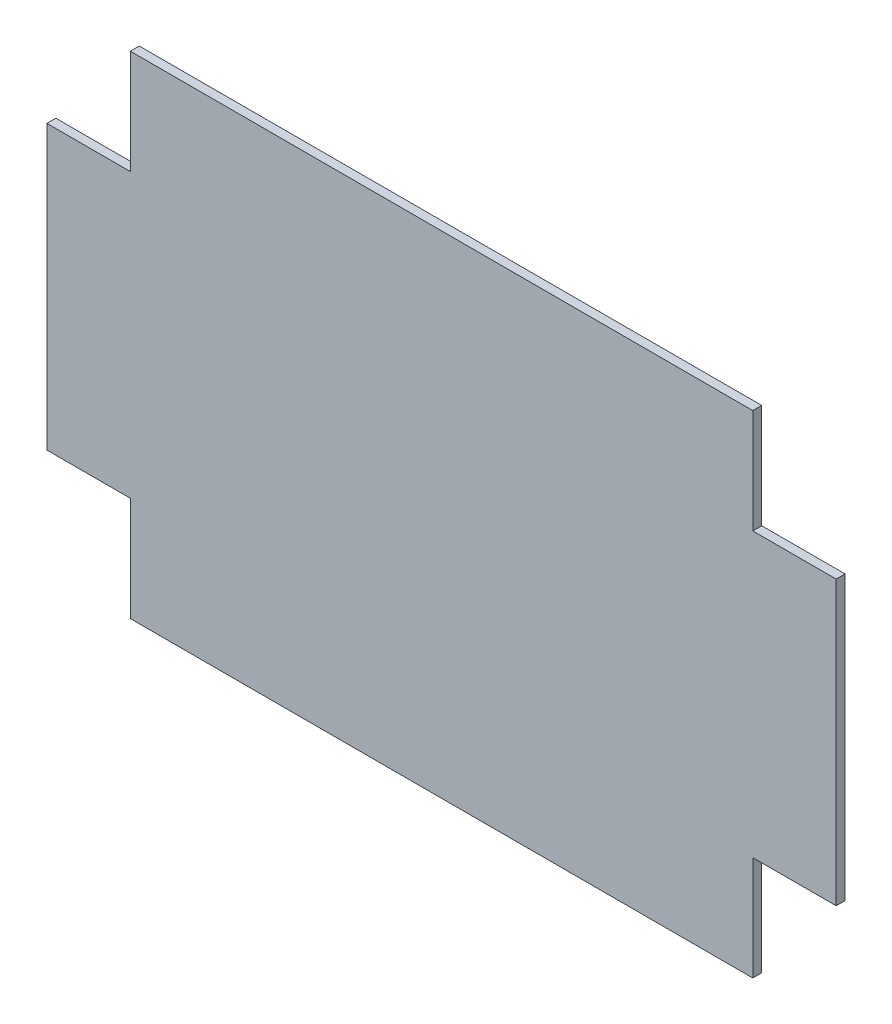
ISO-10303-21;
HEADER;
FILE_DESCRIPTION(('STEP AP214'),'2;1');
FILE_NAME('part.step','',(''),(''),'','','');
FILE_SCHEMA(('AUTOMOTIVE_DESIGN { 1 0 10303 214 1 1 1 1 }'));
ENDSEC;
DATA;
#1=APPLICATION_CONTEXT('core data for automotive mechanical design processes');
#2=APPLICATION_PROTOCOL_DEFINITION('international standard','automotive_design',2000,#1);
#3=PRODUCT_CONTEXT('',#1,'mechanical');
#4=PRODUCT('Part','Part','',(#3));
#5=PRODUCT_RELATED_PRODUCT_CATEGORY('part','',(#4));
#6=PRODUCT_DEFINITION_FORMATION('','',#4);
#7=PRODUCT_DEFINITION_CONTEXT('part definition',#1,'design');
#8=PRODUCT_DEFINITION('design','',#6,#7);
#9=PRODUCT_DEFINITION_SHAPE('','',#8);
#10=(LENGTH_UNIT() NAMED_UNIT(*) SI_UNIT(.MILLI.,.METRE.));
#11=(NAMED_UNIT(*) PLANE_ANGLE_UNIT() SI_UNIT($,.RADIAN.));
#12=(NAMED_UNIT(*) SI_UNIT($,.STERADIAN.) SOLID_ANGLE_UNIT());
#13=UNCERTAINTY_MEASURE_WITH_UNIT(LENGTH_MEASURE(1.E-05),#10,'distance_accuracy_value','');
#14=(GEOMETRIC_REPRESENTATION_CONTEXT(3) GLOBAL_UNCERTAINTY_ASSIGNED_CONTEXT((#13)) GLOBAL_UNIT_ASSIGNED_CONTEXT((#10,
#11,#12)) REPRESENTATION_CONTEXT('',''));
#15=CARTESIAN_POINT('',(0.,0.,0.));
#16=DIRECTION('',(0.,0.,1.));
#17=DIRECTION('',(1.,0.,0.));
#18=AXIS2_PLACEMENT_3D('',#15,#16,#17);
#19=CARTESIAN_POINT('',(-132.5,47.5,3.));
#20=DIRECTION('',(0.,-1.,0.));
#21=DIRECTION('',(0.,0.,-1.));
#22=AXIS2_PLACEMENT_3D('',#19,#20,#21);
#23=PLANE('',#22);
#24=DIRECTION('',(-1.,0.,0.));
#25=VECTOR('',#24,1.);
#26=CARTESIAN_POINT('',(-132.5,47.5,0.));
#27=LINE('',#26,#25);
#28=CARTESIAN_POINT('',(-104.5,47.5,0.));
#29=VERTEX_POINT('',#28);
#30=CARTESIAN_POINT('',(-132.5,47.5,0.));
#31=VERTEX_POINT('',#30);
#32=EDGE_CURVE('E161',#29,#31,#27,.T.);
#33=ORIENTED_EDGE('',*,*,#32,.T.);
#34=DIRECTION('',(0.,0.,-1.));
#35=VECTOR('',#34,1.);
#36=CARTESIAN_POINT('',(-132.5,47.5,3.));
#37=LINE('',#36,#35);
#38=CARTESIAN_POINT('',(-132.5,47.5,3.));
#39=VERTEX_POINT('',#38);
#40=EDGE_CURVE('E11',#39,#31,#37,.T.);
#41=ORIENTED_EDGE('',*,*,#40,.F.);
#42=DIRECTION('',(-1.,0.,0.));
#43=VECTOR('',#42,1.);
#44=CARTESIAN_POINT('',(-132.5,47.5,3.));
#45=LINE('',#44,#43);
#46=CARTESIAN_POINT('',(-104.5,47.5,3.));
#47=VERTEX_POINT('',#46);
#48=EDGE_CURVE('E183',#47,#39,#45,.T.);
#49=ORIENTED_EDGE('',*,*,#48,.F.);
#50=DIRECTION('',(0.,0.,-1.));
#51=VECTOR('',#50,1.);
#52=CARTESIAN_POINT('',(-104.5,47.5,3.));
#53=LINE('',#52,#51);
#54=EDGE_CURVE('E160',#47,#29,#53,.T.);
#55=ORIENTED_EDGE('',*,*,#54,.T.);
#56=EDGE_LOOP('',(#33,#41,#49,#55));
#57=FACE_BOUND('',#56,.T.);
#58=ADVANCED_FACE('F41',(#57),#23,.F.);
#59=CARTESIAN_POINT('',(-132.5,47.5,3.));
#60=DIRECTION('',(1.,0.,0.));
#61=DIRECTION('',(0.,0.,-1.));
#62=AXIS2_PLACEMENT_3D('',#59,#60,#61);
#63=PLANE('',#62);
#64=DIRECTION('',(0.,-1.,0.));
#65=VECTOR('',#64,1.);
#66=CARTESIAN_POINT('',(-132.5,47.5,0.));
#67=LINE('',#66,#65);
#68=CARTESIAN_POINT('',(-132.5,-47.5,0.));
#69=VERTEX_POINT('',#68);
#70=EDGE_CURVE('E163',#31,#69,#67,.T.);
#71=ORIENTED_EDGE('',*,*,#70,.T.);
#72=DIRECTION('',(0.,0.,-1.));
#73=VECTOR('',#72,1.);
#74=CARTESIAN_POINT('',(-132.5,-47.5,3.));
#75=LINE('',#74,#73);
#76=CARTESIAN_POINT('',(-132.5,-47.5,3.));
#77=VERTEX_POINT('',#76);
#78=EDGE_CURVE('E47',#77,#69,#75,.T.);
#79=ORIENTED_EDGE('',*,*,#78,.F.);
#80=DIRECTION('',(0.,-1.,0.));
#81=VECTOR('',#80,1.);
#82=CARTESIAN_POINT('',(-132.5,47.5,3.));
#83=LINE('',#82,#81);
#84=EDGE_CURVE('E115',#39,#77,#83,.T.);
#85=ORIENTED_EDGE('',*,*,#84,.F.);
#86=ORIENTED_EDGE('',*,*,#40,.T.);
#87=EDGE_LOOP('',(#71,#79,#85,#86));
#88=FACE_BOUND('',#87,.T.);
#89=ADVANCED_FACE('F263',(#88),#63,.F.);
#90=CARTESIAN_POINT('',(-132.5,-47.5,3.));
#91=DIRECTION('',(0.,1.,0.));
#92=DIRECTION('',(0.,0.,1.));
#93=AXIS2_PLACEMENT_3D('',#90,#91,#92);
#94=PLANE('',#93);
#95=DIRECTION('',(1.,0.,0.));
#96=VECTOR('',#95,1.);
#97=CARTESIAN_POINT('',(-132.5,-47.5,0.));
#98=LINE('',#97,#96);
#99=CARTESIAN_POINT('',(-104.5,-47.5,0.));
#100=VERTEX_POINT('',#99);
#101=EDGE_CURVE('E168',#69,#100,#98,.T.);
#102=ORIENTED_EDGE('',*,*,#101,.T.);
#103=DIRECTION('',(0.,0.,-1.));
#104=VECTOR('',#103,1.);
#105=CARTESIAN_POINT('',(-104.5,-47.5,3.));
#106=LINE('',#105,#104);
#107=CARTESIAN_POINT('',(-104.5,-47.5,3.));
#108=VERTEX_POINT('',#107);
#109=EDGE_CURVE('E205',#108,#100,#106,.T.);
#110=ORIENTED_EDGE('',*,*,#109,.F.);
#111=DIRECTION('',(1.,0.,0.));
#112=VECTOR('',#111,1.);
#113=CARTESIAN_POINT('',(-132.5,-47.5,3.));
#114=LINE('',#113,#112);
#115=EDGE_CURVE('E210',#77,#108,#114,.T.);
#116=ORIENTED_EDGE('',*,*,#115,.F.);
#117=ORIENTED_EDGE('',*,*,#78,.T.);
#118=EDGE_LOOP('',(#102,#110,#116,#117));
#119=FACE_BOUND('',#118,.T.);
#120=ADVANCED_FACE('F209',(#119),#94,.F.);
#121=CARTESIAN_POINT('',(-104.5,-47.5,3.));
#122=DIRECTION('',(1.,0.,0.));
#123=DIRECTION('',(0.,0.,-1.));
#124=AXIS2_PLACEMENT_3D('',#121,#122,#123);
#125=PLANE('',#124);
#126=DIRECTION('',(0.,-1.,0.));
#127=VECTOR('',#126,1.);
#128=CARTESIAN_POINT('',(-104.5,-47.5,0.));
#129=LINE('',#128,#127);
#130=CARTESIAN_POINT('',(-104.5,-82.5,0.));
#131=VERTEX_POINT('',#130);
#132=EDGE_CURVE('E166',#100,#131,#129,.T.);
#133=ORIENTED_EDGE('',*,*,#132,.T.);
#134=DIRECTION('',(0.,0.,-1.));
#135=VECTOR('',#134,1.);
#136=CARTESIAN_POINT('',(-104.5,-82.5,3.));
#137=LINE('',#136,#135);
#138=CARTESIAN_POINT('',(-104.5,-82.5,3.));
#139=VERTEX_POINT('',#138);
#140=EDGE_CURVE('E198',#139,#131,#137,.T.);
#141=ORIENTED_EDGE('',*,*,#140,.F.);
#142=DIRECTION('',(0.,-1.,0.));
#143=VECTOR('',#142,1.);
#144=CARTESIAN_POINT('',(-104.5,-47.5,3.));
#145=LINE('',#144,#143);
#146=EDGE_CURVE('E228',#108,#139,#145,.T.);
#147=ORIENTED_EDGE('',*,*,#146,.F.);
#148=ORIENTED_EDGE('',*,*,#109,.T.);
#149=EDGE_LOOP('',(#133,#141,#147,#148));
#150=FACE_BOUND('',#149,.T.);
#151=ADVANCED_FACE('F219',(#150),#125,.F.);
#152=CARTESIAN_POINT('',(104.5,-82.5,3.));
#153=DIRECTION('',(0.,1.,0.));
#154=DIRECTION('',(0.,0.,1.));
#155=AXIS2_PLACEMENT_3D('',#152,#153,#154);
#156=PLANE('',#155);
#157=DIRECTION('',(1.,0.,0.));
#158=VECTOR('',#157,1.);
#159=CARTESIAN_POINT('',(104.5,-82.5,0.));
#160=LINE('',#159,#158);
#161=CARTESIAN_POINT('',(104.5,-82.5,0.));
#162=VERTEX_POINT('',#161);
#163=EDGE_CURVE('E169',#131,#162,#160,.T.);
#164=ORIENTED_EDGE('',*,*,#163,.T.);
#165=DIRECTION('',(0.,0.,-1.));
#166=VECTOR('',#165,1.);
#167=CARTESIAN_POINT('',(104.5,-82.5,3.));
#168=LINE('',#167,#166);
#169=CARTESIAN_POINT('',(104.5,-82.5,3.));
#170=VERTEX_POINT('',#169);
#171=EDGE_CURVE('E196',#170,#162,#168,.T.);
#172=ORIENTED_EDGE('',*,*,#171,.F.);
#173=DIRECTION('',(1.,0.,0.));
#174=VECTOR('',#173,1.);
#175=CARTESIAN_POINT('',(104.5,-82.5,3.));
#176=LINE('',#175,#174);
#177=EDGE_CURVE('E224',#139,#170,#176,.T.);
#178=ORIENTED_EDGE('',*,*,#177,.F.);
#179=ORIENTED_EDGE('',*,*,#140,.T.);
#180=EDGE_LOOP('',(#164,#172,#178,#179));
#181=FACE_BOUND('',#180,.T.);
#182=ADVANCED_FACE('F223',(#181),#156,.F.);
#183=CARTESIAN_POINT('',(104.5,-47.5,3.));
#184=DIRECTION('',(-1.,0.,0.));
#185=DIRECTION('',(0.,0.,1.));
#186=AXIS2_PLACEMENT_3D('',#183,#184,#185);
#187=PLANE('',#186);
#188=DIRECTION('',(0.,1.,0.));
#189=VECTOR('',#188,1.);
#190=CARTESIAN_POINT('',(104.5,-47.5,0.));
#191=LINE('',#190,#189);
#192=CARTESIAN_POINT('',(104.5,-47.5,0.));
#193=VERTEX_POINT('',#192);
#194=EDGE_CURVE('E175',#162,#193,#191,.T.);
#195=ORIENTED_EDGE('',*,*,#194,.T.);
#196=DIRECTION('',(0.,0.,-1.));
#197=VECTOR('',#196,1.);
#198=CARTESIAN_POINT('',(104.5,-47.5,3.));
#199=LINE('',#198,#197);
#200=CARTESIAN_POINT('',(104.5,-47.5,3.));
#201=VERTEX_POINT('',#200);
#202=EDGE_CURVE('E194',#201,#193,#199,.T.);
#203=ORIENTED_EDGE('',*,*,#202,.F.);
#204=DIRECTION('',(0.,1.,0.));
#205=VECTOR('',#204,1.);
#206=CARTESIAN_POINT('',(104.5,-47.5,3.));
#207=LINE('',#206,#205);
#208=EDGE_CURVE('E230',#170,#201,#207,.T.);
#209=ORIENTED_EDGE('',*,*,#208,.F.);
#210=ORIENTED_EDGE('',*,*,#171,.T.);
#211=EDGE_LOOP('',(#195,#203,#209,#210));
#212=FACE_BOUND('',#211,.T.);
#213=ADVANCED_FACE('F272',(#212),#187,.F.);
#214=CARTESIAN_POINT('',(132.5,-47.5,3.));
#215=DIRECTION('',(0.,1.,0.));
#216=DIRECTION('',(0.,0.,1.));
#217=AXIS2_PLACEMENT_3D('',#214,#215,#216);
#218=PLANE('',#217);
#219=DIRECTION('',(1.,0.,0.));
#220=VECTOR('',#219,1.);
#221=CARTESIAN_POINT('',(132.5,-47.5,0.));
#222=LINE('',#221,#220);
#223=CARTESIAN_POINT('',(132.5,-47.5,0.));
#224=VERTEX_POINT('',#223);
#225=EDGE_CURVE('E174',#193,#224,#222,.T.);
#226=ORIENTED_EDGE('',*,*,#225,.T.);
#227=DIRECTION('',(0.,0.,-1.));
#228=VECTOR('',#227,1.);
#229=CARTESIAN_POINT('',(132.5,-47.5,3.));
#230=LINE('',#229,#228);
#231=CARTESIAN_POINT('',(132.5,-47.5,3.));
#232=VERTEX_POINT('',#231);
#233=EDGE_CURVE('E189',#232,#224,#230,.T.);
#234=ORIENTED_EDGE('',*,*,#233,.F.);
#235=DIRECTION('',(1.,0.,0.));
#236=VECTOR('',#235,1.);
#237=CARTESIAN_POINT('',(132.5,-47.5,3.));
#238=LINE('',#237,#236);
#239=EDGE_CURVE('E229',#201,#232,#238,.T.);
#240=ORIENTED_EDGE('',*,*,#239,.F.);
#241=ORIENTED_EDGE('',*,*,#202,.T.);
#242=EDGE_LOOP('',(#226,#234,#240,#241));
#243=FACE_BOUND('',#242,.T.);
#244=ADVANCED_FACE('F280',(#243),#218,.F.);
#245=CARTESIAN_POINT('',(132.5,47.5,3.));
#246=DIRECTION('',(-1.,0.,0.));
#247=DIRECTION('',(0.,0.,1.));
#248=AXIS2_PLACEMENT_3D('',#245,#246,#247);
#249=PLANE('',#248);
#250=DIRECTION('',(0.,1.,0.));
#251=VECTOR('',#250,1.);
#252=CARTESIAN_POINT('',(132.5,47.5,0.));
#253=LINE('',#252,#251);
#254=CARTESIAN_POINT('',(132.5,47.5,0.));
#255=VERTEX_POINT('',#254);
#256=EDGE_CURVE('E176',#224,#255,#253,.T.);
#257=ORIENTED_EDGE('',*,*,#256,.T.);
#258=DIRECTION('',(0.,0.,-1.));
#259=VECTOR('',#258,1.);
#260=CARTESIAN_POINT('',(132.5,47.5,3.));
#261=LINE('',#260,#259);
#262=CARTESIAN_POINT('',(132.5,47.5,3.));
#263=VERTEX_POINT('',#262);
#264=EDGE_CURVE('E190',#263,#255,#261,.T.);
#265=ORIENTED_EDGE('',*,*,#264,.F.);
#266=DIRECTION('',(0.,1.,0.));
#267=VECTOR('',#266,1.);
#268=CARTESIAN_POINT('',(132.5,47.5,3.));
#269=LINE('',#268,#267);
#270=EDGE_CURVE('E237',#232,#263,#269,.T.);
#271=ORIENTED_EDGE('',*,*,#270,.F.);
#272=ORIENTED_EDGE('',*,*,#233,.T.);
#273=EDGE_LOOP('',(#257,#265,#271,#272));
#274=FACE_BOUND('',#273,.T.);
#275=ADVANCED_FACE('F242',(#274),#249,.F.);
#276=CARTESIAN_POINT('',(132.5,47.5,3.));
#277=DIRECTION('',(0.,-1.,0.));
#278=DIRECTION('',(0.,0.,-1.));
#279=AXIS2_PLACEMENT_3D('',#276,#277,#278);
#280=PLANE('',#279);
#281=DIRECTION('',(-1.,0.,0.));
#282=VECTOR('',#281,1.);
#283=CARTESIAN_POINT('',(132.5,47.5,0.));
#284=LINE('',#283,#282);
#285=CARTESIAN_POINT('',(104.5,47.5,0.));
#286=VERTEX_POINT('',#285);
#287=EDGE_CURVE('E178',#255,#286,#284,.T.);
#288=ORIENTED_EDGE('',*,*,#287,.T.);
#289=DIRECTION('',(0.,0.,-1.));
#290=VECTOR('',#289,1.);
#291=CARTESIAN_POINT('',(104.5,47.5,3.));
#292=LINE('',#291,#290);
#293=CARTESIAN_POINT('',(104.5,47.5,3.));
#294=VERTEX_POINT('',#293);
#295=EDGE_CURVE('E152',#294,#286,#292,.T.);
#296=ORIENTED_EDGE('',*,*,#295,.F.);
#297=DIRECTION('',(-1.,0.,0.));
#298=VECTOR('',#297,1.);
#299=CARTESIAN_POINT('',(132.5,47.5,3.));
#300=LINE('',#299,#298);
#301=EDGE_CURVE('E142',#263,#294,#300,.T.);
#302=ORIENTED_EDGE('',*,*,#301,.F.);
#303=ORIENTED_EDGE('',*,*,#264,.T.);
#304=EDGE_LOOP('',(#288,#296,#302,#303));
#305=FACE_BOUND('',#304,.T.);
#306=ADVANCED_FACE('F247',(#305),#280,.F.);
#307=CARTESIAN_POINT('',(104.5,47.5,3.));
#308=DIRECTION('',(-1.,0.,0.));
#309=DIRECTION('',(0.,0.,1.));
#310=AXIS2_PLACEMENT_3D('',#307,#308,#309);
#311=PLANE('',#310);
#312=DIRECTION('',(0.,1.,0.));
#313=VECTOR('',#312,1.);
#314=CARTESIAN_POINT('',(104.5,47.5,0.));
#315=LINE('',#314,#313);
#316=CARTESIAN_POINT('',(104.5,82.5,0.));
#317=VERTEX_POINT('',#316);
#318=EDGE_CURVE('E151',#286,#317,#315,.T.);
#319=ORIENTED_EDGE('',*,*,#318,.T.);
#320=DIRECTION('',(0.,0.,-1.));
#321=VECTOR('',#320,1.);
#322=CARTESIAN_POINT('',(104.5,82.5,3.));
#323=LINE('',#322,#321);
#324=CARTESIAN_POINT('',(104.5,82.5,3.));
#325=VERTEX_POINT('',#324);
#326=EDGE_CURVE('E149',#325,#317,#323,.T.);
#327=ORIENTED_EDGE('',*,*,#326,.F.);
#328=DIRECTION('',(0.,1.,0.));
#329=VECTOR('',#328,1.);
#330=CARTESIAN_POINT('',(104.5,47.5,3.));
#331=LINE('',#330,#329);
#332=EDGE_CURVE('E140',#294,#325,#331,.T.);
#333=ORIENTED_EDGE('',*,*,#332,.F.);
#334=ORIENTED_EDGE('',*,*,#295,.T.);
#335=EDGE_LOOP('',(#319,#327,#333,#334));
#336=FACE_BOUND('',#335,.T.);
#337=ADVANCED_FACE('F146',(#336),#311,.F.);
#338=CARTESIAN_POINT('',(104.5,82.5,3.));
#339=DIRECTION('',(0.,-1.,0.));
#340=DIRECTION('',(0.,0.,-1.));
#341=AXIS2_PLACEMENT_3D('',#338,#339,#340);
#342=PLANE('',#341);
#343=DIRECTION('',(-1.,0.,0.));
#344=VECTOR('',#343,1.);
#345=CARTESIAN_POINT('',(104.5,82.5,0.));
#346=LINE('',#345,#344);
#347=CARTESIAN_POINT('',(-104.5,82.5,0.));
#348=VERTEX_POINT('',#347);
#349=EDGE_CURVE('E97',#317,#348,#346,.T.);
#350=ORIENTED_EDGE('',*,*,#349,.T.);
#351=DIRECTION('',(0.,0.,-1.));
#352=VECTOR('',#351,1.);
#353=CARTESIAN_POINT('',(-104.5,82.5,3.));
#354=LINE('',#353,#352);
#355=CARTESIAN_POINT('',(-104.5,82.5,3.));
#356=VERTEX_POINT('',#355);
#357=EDGE_CURVE('E154',#356,#348,#354,.T.);
#358=ORIENTED_EDGE('',*,*,#357,.F.);
#359=DIRECTION('',(-1.,0.,0.));
#360=VECTOR('',#359,1.);
#361=CARTESIAN_POINT('',(104.5,82.5,3.));
#362=LINE('',#361,#360);
#363=EDGE_CURVE('E141',#325,#356,#362,.T.);
#364=ORIENTED_EDGE('',*,*,#363,.F.);
#365=ORIENTED_EDGE('',*,*,#326,.T.);
#366=EDGE_LOOP('',(#350,#358,#364,#365));
#367=FACE_BOUND('',#366,.T.);
#368=ADVANCED_FACE('F155',(#367),#342,.F.);
#369=CARTESIAN_POINT('',(-104.5,47.5,3.));
#370=DIRECTION('',(1.,0.,0.));
#371=DIRECTION('',(0.,0.,-1.));
#372=AXIS2_PLACEMENT_3D('',#369,#370,#371);
#373=PLANE('',#372);
#374=DIRECTION('',(0.,-1.,0.));
#375=VECTOR('',#374,1.);
#376=CARTESIAN_POINT('',(-104.5,47.5,0.));
#377=LINE('',#376,#375);
#378=EDGE_CURVE('E101',#348,#29,#377,.T.);
#379=ORIENTED_EDGE('',*,*,#378,.T.);
#380=ORIENTED_EDGE('',*,*,#54,.F.);
#381=DIRECTION('',(0.,-1.,0.));
#382=VECTOR('',#381,1.);
#383=CARTESIAN_POINT('',(-104.5,47.5,3.));
#384=LINE('',#383,#382);
#385=EDGE_CURVE('E60',#356,#47,#384,.T.);
#386=ORIENTED_EDGE('',*,*,#385,.F.);
#387=ORIENTED_EDGE('',*,*,#357,.T.);
#388=EDGE_LOOP('',(#379,#380,#386,#387));
#389=FACE_BOUND('',#388,.T.);
#390=ADVANCED_FACE('F248',(#389),#373,.F.);
#391=CARTESIAN_POINT('',(0.,0.,3.));
#392=DIRECTION('',(0.,0.,1.));
#393=DIRECTION('',(1.,0.,0.));
#394=AXIS2_PLACEMENT_3D('',#391,#392,#393);
#395=PLANE('',#394);
#396=ORIENTED_EDGE('',*,*,#48,.T.);
#397=ORIENTED_EDGE('',*,*,#84,.T.);
#398=ORIENTED_EDGE('',*,*,#115,.T.);
#399=ORIENTED_EDGE('',*,*,#146,.T.);
#400=ORIENTED_EDGE('',*,*,#177,.T.);
#401=ORIENTED_EDGE('',*,*,#208,.T.);
#402=ORIENTED_EDGE('',*,*,#239,.T.);
#403=ORIENTED_EDGE('',*,*,#270,.T.);
#404=ORIENTED_EDGE('',*,*,#301,.T.);
#405=ORIENTED_EDGE('',*,*,#332,.T.);
#406=ORIENTED_EDGE('',*,*,#363,.T.);
#407=ORIENTED_EDGE('',*,*,#385,.T.);
#408=EDGE_LOOP('',(#396,#397,#398,#399,#400,#401,#402,#403,#404,#405,#406,#407));
#409=FACE_BOUND('',#408,.T.);
#410=ADVANCED_FACE('F137',(#409),#395,.T.);
#411=CARTESIAN_POINT('',(0.,0.,0.));
#412=DIRECTION('',(0.,0.,1.));
#413=DIRECTION('',(1.,0.,0.));
#414=AXIS2_PLACEMENT_3D('',#411,#412,#413);
#415=PLANE('',#414);
#416=ORIENTED_EDGE('',*,*,#32,.F.);
#417=ORIENTED_EDGE('',*,*,#378,.F.);
#418=ORIENTED_EDGE('',*,*,#349,.F.);
#419=ORIENTED_EDGE('',*,*,#318,.F.);
#420=ORIENTED_EDGE('',*,*,#287,.F.);
#421=ORIENTED_EDGE('',*,*,#256,.F.);
#422=ORIENTED_EDGE('',*,*,#225,.F.);
#423=ORIENTED_EDGE('',*,*,#194,.F.);
#424=ORIENTED_EDGE('',*,*,#163,.F.);
#425=ORIENTED_EDGE('',*,*,#132,.F.);
#426=ORIENTED_EDGE('',*,*,#101,.F.);
#427=ORIENTED_EDGE('',*,*,#70,.F.);
#428=EDGE_LOOP('',(#416,#417,#418,#419,#420,#421,#422,#423,#424,#425,#426,#427));
#429=FACE_BOUND('',#428,.T.);
#430=ADVANCED_FACE('F215',(#429),#415,.F.);
#431=CLOSED_SHELL('',(#58,#89,#120,#151,#182,#213,#244,#275,#306,#337,#368,#390,#410,#430));
#432=MANIFOLD_SOLID_BREP('B2',#431);
#433=ADVANCED_BREP_SHAPE_REPRESENTATION('',(#18,#432),#14);
#434=SHAPE_DEFINITION_REPRESENTATION(#9,#433);
ENDSEC;
END-ISO-10303-21;
